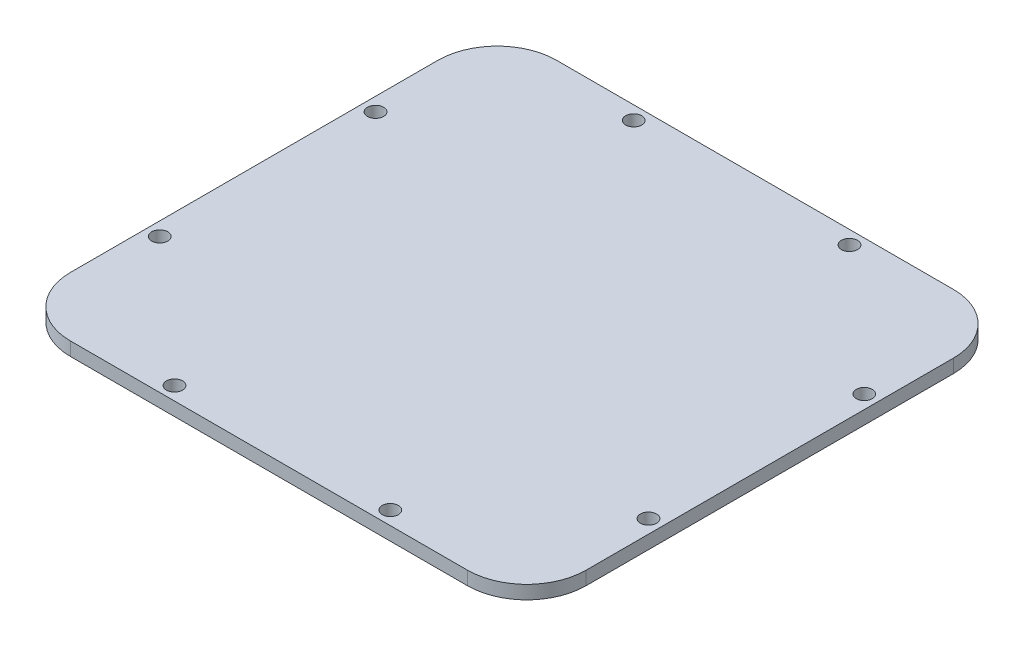
ISO-10303-21;
HEADER;
FILE_DESCRIPTION(('STEP AP214'),'2;1');
FILE_NAME('part.step','',(''),(''),'','','');
FILE_SCHEMA(('AUTOMOTIVE_DESIGN { 1 0 10303 214 1 1 1 1 }'));
ENDSEC;
DATA;
#1=APPLICATION_CONTEXT('core data for automotive mechanical design processes');
#2=APPLICATION_PROTOCOL_DEFINITION('international standard','automotive_design',2000,#1);
#3=PRODUCT_CONTEXT('',#1,'mechanical');
#4=PRODUCT('Part','Part','',(#3));
#5=PRODUCT_RELATED_PRODUCT_CATEGORY('part','',(#4));
#6=PRODUCT_DEFINITION_FORMATION('','',#4);
#7=PRODUCT_DEFINITION_CONTEXT('part definition',#1,'design');
#8=PRODUCT_DEFINITION('design','',#6,#7);
#9=PRODUCT_DEFINITION_SHAPE('','',#8);
#10=(LENGTH_UNIT() NAMED_UNIT(*) SI_UNIT(.MILLI.,.METRE.));
#11=(NAMED_UNIT(*) PLANE_ANGLE_UNIT() SI_UNIT($,.RADIAN.));
#12=(NAMED_UNIT(*) SI_UNIT($,.STERADIAN.) SOLID_ANGLE_UNIT());
#13=UNCERTAINTY_MEASURE_WITH_UNIT(LENGTH_MEASURE(1.E-05),#10,'distance_accuracy_value','');
#14=(GEOMETRIC_REPRESENTATION_CONTEXT(3) GLOBAL_UNCERTAINTY_ASSIGNED_CONTEXT((#13)) GLOBAL_UNIT_ASSIGNED_CONTEXT((#10,
#11,#12)) REPRESENTATION_CONTEXT('',''));
#15=CARTESIAN_POINT('',(0.,0.,0.));
#16=DIRECTION('',(0.,0.,1.));
#17=DIRECTION('',(1.,0.,0.));
#18=AXIS2_PLACEMENT_3D('',#15,#16,#17);
#19=CARTESIAN_POINT('',(0.,0.,0.));
#20=DIRECTION('',(0.,1.,0.));
#21=DIRECTION('',(0.,0.,1.));
#22=AXIS2_PLACEMENT_3D('',#19,#20,#21);
#23=PLANE('',#22);
#24=CARTESIAN_POINT('',(25.4,0.,-54.0512));
#25=DIRECTION('',(0.,-1.,0.));
#26=DIRECTION('',(0.,0.,-1.));
#27=AXIS2_PLACEMENT_3D('',#24,#25,#26);
#28=CIRCLE('',#27,1.89864999999999);
#29=CARTESIAN_POINT('',(25.4,0.,-55.94985));
#30=VERTEX_POINT('',#29);
#31=EDGE_CURVE('E224',#30,#30,#28,.T.);
#32=ORIENTED_EDGE('',*,*,#31,.F.);
#33=EDGE_LOOP('',(#32));
#34=FACE_BOUND('',#33,.T.);
#35=CARTESIAN_POINT('',(57.531,0.,-25.4));
#36=DIRECTION('',(0.,-1.,0.));
#37=DIRECTION('',(0.,0.,-1.));
#38=AXIS2_PLACEMENT_3D('',#35,#36,#37);
#39=CIRCLE('',#38,1.89864999999999);
#40=CARTESIAN_POINT('',(57.531,0.,-27.29865));
#41=VERTEX_POINT('',#40);
#42=EDGE_CURVE('E218',#41,#41,#39,.T.);
#43=ORIENTED_EDGE('',*,*,#42,.F.);
#44=EDGE_LOOP('',(#43));
#45=FACE_BOUND('',#44,.T.);
#46=CARTESIAN_POINT('',(57.531,0.,25.4));
#47=DIRECTION('',(0.,-1.,0.));
#48=DIRECTION('',(0.,0.,-1.));
#49=AXIS2_PLACEMENT_3D('',#46,#47,#48);
#50=CIRCLE('',#49,1.89864999999999);
#51=CARTESIAN_POINT('',(57.531,0.,23.50135));
#52=VERTEX_POINT('',#51);
#53=EDGE_CURVE('E212',#52,#52,#50,.T.);
#54=ORIENTED_EDGE('',*,*,#53,.F.);
#55=EDGE_LOOP('',(#54));
#56=FACE_BOUND('',#55,.T.);
#57=CARTESIAN_POINT('',(-25.4,0.,-54.0512));
#58=DIRECTION('',(0.,-1.,0.));
#59=DIRECTION('',(0.,0.,-1.));
#60=AXIS2_PLACEMENT_3D('',#57,#58,#59);
#61=CIRCLE('',#60,1.89864999999999);
#62=CARTESIAN_POINT('',(-25.4,0.,-55.94985));
#63=VERTEX_POINT('',#62);
#64=EDGE_CURVE('E200',#63,#63,#61,.T.);
#65=ORIENTED_EDGE('',*,*,#64,.F.);
#66=EDGE_LOOP('',(#65));
#67=FACE_BOUND('',#66,.T.);
#68=CARTESIAN_POINT('',(-57.531,0.,-25.4));
#69=DIRECTION('',(0.,-1.,0.));
#70=DIRECTION('',(0.,0.,-1.));
#71=AXIS2_PLACEMENT_3D('',#68,#69,#70);
#72=CIRCLE('',#71,1.89864999999999);
#73=CARTESIAN_POINT('',(-57.531,0.,-27.29865));
#74=VERTEX_POINT('',#73);
#75=EDGE_CURVE('E194',#74,#74,#72,.T.);
#76=ORIENTED_EDGE('',*,*,#75,.F.);
#77=EDGE_LOOP('',(#76));
#78=FACE_BOUND('',#77,.T.);
#79=CARTESIAN_POINT('',(-57.531,0.,25.4));
#80=DIRECTION('',(0.,-1.,0.));
#81=DIRECTION('',(0.,0.,-1.));
#82=AXIS2_PLACEMENT_3D('',#79,#80,#81);
#83=CIRCLE('',#82,1.89864999999999);
#84=CARTESIAN_POINT('',(-57.531,0.,23.50135));
#85=VERTEX_POINT('',#84);
#86=EDGE_CURVE('E188',#85,#85,#83,.T.);
#87=ORIENTED_EDGE('',*,*,#86,.F.);
#88=EDGE_LOOP('',(#87));
#89=FACE_BOUND('',#88,.T.);
#90=CARTESIAN_POINT('',(-25.4,0.,54.0512));
#91=DIRECTION('',(0.,-1.,0.));
#92=DIRECTION('',(0.,0.,-1.));
#93=AXIS2_PLACEMENT_3D('',#90,#91,#92);
#94=CIRCLE('',#93,1.89864999999999);
#95=CARTESIAN_POINT('',(-25.4,0.,52.15255));
#96=VERTEX_POINT('',#95);
#97=EDGE_CURVE('E133',#96,#96,#94,.T.);
#98=ORIENTED_EDGE('',*,*,#97,.F.);
#99=EDGE_LOOP('',(#98));
#100=FACE_BOUND('',#99,.T.);
#101=DIRECTION('',(0.,0.,1.));
#102=VECTOR('',#101,1.);
#103=CARTESIAN_POINT('',(-60.706,0.,57.2262));
#104=LINE('',#103,#102);
#105=CARTESIAN_POINT('',(-60.706,0.,-43.2562));
#106=VERTEX_POINT('',#105);
#107=CARTESIAN_POINT('',(-60.706,0.,43.2562));
#108=VERTEX_POINT('',#107);
#109=EDGE_CURVE('E116',#106,#108,#104,.T.);
#110=ORIENTED_EDGE('',*,*,#109,.F.);
#111=CARTESIAN_POINT('',(-46.736,0.,-43.2562));
#112=DIRECTION('',(0.,1.,0.));
#113=DIRECTION('',(0.,0.,1.));
#114=AXIS2_PLACEMENT_3D('',#111,#112,#113);
#115=CIRCLE('',#114,13.97);
#116=CARTESIAN_POINT('',(-46.736,0.,-57.2262));
#117=VERTEX_POINT('',#116);
#118=EDGE_CURVE('E99',#106,#117,#115,.F.);
#119=ORIENTED_EDGE('',*,*,#118,.T.);
#120=DIRECTION('',(-1.,0.,0.));
#121=VECTOR('',#120,1.);
#122=CARTESIAN_POINT('',(60.706,0.,-57.2262));
#123=LINE('',#122,#121);
#124=CARTESIAN_POINT('',(46.736,0.,-57.2262));
#125=VERTEX_POINT('',#124);
#126=EDGE_CURVE('E140',#125,#117,#123,.T.);
#127=ORIENTED_EDGE('',*,*,#126,.F.);
#128=CARTESIAN_POINT('',(46.736,0.,-43.2562));
#129=DIRECTION('',(0.,1.,0.));
#130=DIRECTION('',(0.,0.,1.));
#131=AXIS2_PLACEMENT_3D('',#128,#129,#130);
#132=CIRCLE('',#131,13.97);
#133=CARTESIAN_POINT('',(60.706,0.,-43.2562));
#134=VERTEX_POINT('',#133);
#135=EDGE_CURVE('E110',#125,#134,#132,.F.);
#136=ORIENTED_EDGE('',*,*,#135,.T.);
#137=DIRECTION('',(0.,0.,-1.));
#138=VECTOR('',#137,1.);
#139=CARTESIAN_POINT('',(60.706,0.,57.2262));
#140=LINE('',#139,#138);
#141=CARTESIAN_POINT('',(60.706,0.,43.2562));
#142=VERTEX_POINT('',#141);
#143=EDGE_CURVE('E130',#142,#134,#140,.T.);
#144=ORIENTED_EDGE('',*,*,#143,.F.);
#145=CARTESIAN_POINT('',(46.736,0.,43.2562));
#146=DIRECTION('',(0.,1.,0.));
#147=DIRECTION('',(0.,0.,1.));
#148=AXIS2_PLACEMENT_3D('',#145,#146,#147);
#149=CIRCLE('',#148,13.97);
#150=CARTESIAN_POINT('',(46.736,0.,57.2262));
#151=VERTEX_POINT('',#150);
#152=EDGE_CURVE('E120',#142,#151,#149,.F.);
#153=ORIENTED_EDGE('',*,*,#152,.T.);
#154=DIRECTION('',(1.,0.,0.));
#155=VECTOR('',#154,1.);
#156=CARTESIAN_POINT('',(60.706,0.,57.2262));
#157=LINE('',#156,#155);
#158=CARTESIAN_POINT('',(-46.736,0.,57.2262));
#159=VERTEX_POINT('',#158);
#160=EDGE_CURVE('E126',#159,#151,#157,.T.);
#161=ORIENTED_EDGE('',*,*,#160,.F.);
#162=CARTESIAN_POINT('',(-46.736,0.,43.2562));
#163=DIRECTION('',(0.,1.,0.));
#164=DIRECTION('',(0.,0.,1.));
#165=AXIS2_PLACEMENT_3D('',#162,#163,#164);
#166=CIRCLE('',#165,13.97);
#167=EDGE_CURVE('E125',#159,#108,#166,.F.);
#168=ORIENTED_EDGE('',*,*,#167,.T.);
#169=EDGE_LOOP('',(#110,#119,#127,#136,#144,#153,#161,#168));
#170=FACE_BOUND('',#169,.T.);
#171=CARTESIAN_POINT('',(25.4,0.,54.0512));
#172=DIRECTION('',(0.,-1.,0.));
#173=DIRECTION('',(0.,0.,-1.));
#174=AXIS2_PLACEMENT_3D('',#171,#172,#173);
#175=CIRCLE('',#174,1.89864999999999);
#176=CARTESIAN_POINT('',(25.4,0.,52.15255));
#177=VERTEX_POINT('',#176);
#178=EDGE_CURVE('E206',#177,#177,#175,.T.);
#179=ORIENTED_EDGE('',*,*,#178,.F.);
#180=EDGE_LOOP('',(#179));
#181=FACE_BOUND('',#180,.T.);
#182=ADVANCED_FACE('F32',(#34,#45,#56,#67,#78,#89,#100,#170,#181),#23,.F.);
#183=CARTESIAN_POINT('',(-60.706,3.175,57.2262));
#184=DIRECTION('',(1.,0.,0.));
#185=DIRECTION('',(0.,0.,-1.));
#186=AXIS2_PLACEMENT_3D('',#183,#184,#185);
#187=PLANE('',#186);
#188=DIRECTION('',(0.,0.,1.));
#189=VECTOR('',#188,1.);
#190=CARTESIAN_POINT('',(-60.706,3.175,57.2262));
#191=LINE('',#190,#189);
#192=CARTESIAN_POINT('',(-60.706,3.175,-43.2562));
#193=VERTEX_POINT('',#192);
#194=CARTESIAN_POINT('',(-60.706,3.175,43.2562));
#195=VERTEX_POINT('',#194);
#196=EDGE_CURVE('E119',#193,#195,#191,.T.);
#197=ORIENTED_EDGE('',*,*,#196,.F.);
#198=DIRECTION('',(0.,-1.,0.));
#199=VECTOR('',#198,1.);
#200=CARTESIAN_POINT('',(-60.706,3.175,-43.2562));
#201=LINE('',#200,#199);
#202=EDGE_CURVE('E103',#193,#106,#201,.T.);
#203=ORIENTED_EDGE('',*,*,#202,.T.);
#204=ORIENTED_EDGE('',*,*,#109,.T.);
#205=DIRECTION('',(0.,-1.,0.));
#206=VECTOR('',#205,1.);
#207=CARTESIAN_POINT('',(-60.706,3.175,43.2562));
#208=LINE('',#207,#206);
#209=EDGE_CURVE('E121',#108,#195,#208,.F.);
#210=ORIENTED_EDGE('',*,*,#209,.T.);
#211=EDGE_LOOP('',(#197,#203,#204,#210));
#212=FACE_BOUND('',#211,.T.);
#213=ADVANCED_FACE('F115',(#212),#187,.F.);
#214=CARTESIAN_POINT('',(60.706,3.175,57.2262));
#215=DIRECTION('',(0.,0.,-1.));
#216=DIRECTION('',(-1.,0.,0.));
#217=AXIS2_PLACEMENT_3D('',#214,#215,#216);
#218=PLANE('',#217);
#219=DIRECTION('',(1.,0.,0.));
#220=VECTOR('',#219,1.);
#221=CARTESIAN_POINT('',(60.706,3.175,57.2262));
#222=LINE('',#221,#220);
#223=CARTESIAN_POINT('',(-46.736,3.175,57.2262));
#224=VERTEX_POINT('',#223);
#225=CARTESIAN_POINT('',(46.736,3.175,57.2262));
#226=VERTEX_POINT('',#225);
#227=EDGE_CURVE('E163',#224,#226,#222,.T.);
#228=ORIENTED_EDGE('',*,*,#227,.F.);
#229=DIRECTION('',(0.,-1.,0.));
#230=VECTOR('',#229,1.);
#231=CARTESIAN_POINT('',(-46.736,3.175,57.2262));
#232=LINE('',#231,#230);
#233=EDGE_CURVE('E11',#224,#159,#232,.T.);
#234=ORIENTED_EDGE('',*,*,#233,.T.);
#235=ORIENTED_EDGE('',*,*,#160,.T.);
#236=DIRECTION('',(0.,-1.,0.));
#237=VECTOR('',#236,1.);
#238=CARTESIAN_POINT('',(46.736,3.175,57.2262));
#239=LINE('',#238,#237);
#240=EDGE_CURVE('E40',#151,#226,#239,.F.);
#241=ORIENTED_EDGE('',*,*,#240,.T.);
#242=EDGE_LOOP('',(#228,#234,#235,#241));
#243=FACE_BOUND('',#242,.T.);
#244=ADVANCED_FACE('F162',(#243),#218,.F.);
#245=CARTESIAN_POINT('',(60.706,3.175,57.2262));
#246=DIRECTION('',(-1.,0.,0.));
#247=DIRECTION('',(0.,0.,1.));
#248=AXIS2_PLACEMENT_3D('',#245,#246,#247);
#249=PLANE('',#248);
#250=ORIENTED_EDGE('',*,*,#143,.T.);
#251=DIRECTION('',(0.,-1.,0.));
#252=VECTOR('',#251,1.);
#253=CARTESIAN_POINT('',(60.706,3.175,-43.2562));
#254=LINE('',#253,#252);
#255=CARTESIAN_POINT('',(60.706,3.175,-43.2562));
#256=VERTEX_POINT('',#255);
#257=EDGE_CURVE('E47',#134,#256,#254,.F.);
#258=ORIENTED_EDGE('',*,*,#257,.T.);
#259=DIRECTION('',(0.,0.,-1.));
#260=VECTOR('',#259,1.);
#261=CARTESIAN_POINT('',(60.706,3.175,57.2262));
#262=LINE('',#261,#260);
#263=CARTESIAN_POINT('',(60.706,3.175,43.2562));
#264=VERTEX_POINT('',#263);
#265=EDGE_CURVE('E169',#264,#256,#262,.T.);
#266=ORIENTED_EDGE('',*,*,#265,.F.);
#267=DIRECTION('',(0.,-1.,0.));
#268=VECTOR('',#267,1.);
#269=CARTESIAN_POINT('',(60.706,3.175,43.2562));
#270=LINE('',#269,#268);
#271=EDGE_CURVE('E156',#264,#142,#270,.T.);
#272=ORIENTED_EDGE('',*,*,#271,.T.);
#273=EDGE_LOOP('',(#250,#258,#266,#272));
#274=FACE_BOUND('',#273,.T.);
#275=ADVANCED_FACE('F173',(#274),#249,.F.);
#276=CARTESIAN_POINT('',(60.706,3.175,-57.2262));
#277=DIRECTION('',(0.,0.,1.));
#278=DIRECTION('',(1.,0.,0.));
#279=AXIS2_PLACEMENT_3D('',#276,#277,#278);
#280=PLANE('',#279);
#281=ORIENTED_EDGE('',*,*,#126,.T.);
#282=DIRECTION('',(0.,-1.,0.));
#283=VECTOR('',#282,1.);
#284=CARTESIAN_POINT('',(-46.736,3.175,-57.2262));
#285=LINE('',#284,#283);
#286=CARTESIAN_POINT('',(-46.736,3.175,-57.2262));
#287=VERTEX_POINT('',#286);
#288=EDGE_CURVE('E104',#117,#287,#285,.F.);
#289=ORIENTED_EDGE('',*,*,#288,.T.);
#290=DIRECTION('',(-1.,0.,0.));
#291=VECTOR('',#290,1.);
#292=CARTESIAN_POINT('',(60.706,3.175,-57.2262));
#293=LINE('',#292,#291);
#294=CARTESIAN_POINT('',(46.736,3.175,-57.2262));
#295=VERTEX_POINT('',#294);
#296=EDGE_CURVE('E136',#295,#287,#293,.T.);
#297=ORIENTED_EDGE('',*,*,#296,.F.);
#298=DIRECTION('',(0.,-1.,0.));
#299=VECTOR('',#298,1.);
#300=CARTESIAN_POINT('',(46.736,3.175,-57.2262));
#301=LINE('',#300,#299);
#302=EDGE_CURVE('E109',#295,#125,#301,.T.);
#303=ORIENTED_EDGE('',*,*,#302,.T.);
#304=EDGE_LOOP('',(#281,#289,#297,#303));
#305=FACE_BOUND('',#304,.T.);
#306=ADVANCED_FACE('F180',(#305),#280,.F.);
#307=CARTESIAN_POINT('',(0.,3.175,0.));
#308=DIRECTION('',(0.,1.,0.));
#309=DIRECTION('',(0.,0.,1.));
#310=AXIS2_PLACEMENT_3D('',#307,#308,#309);
#311=PLANE('',#310);
#312=CARTESIAN_POINT('',(25.4,3.175,-54.0512));
#313=DIRECTION('',(0.,-1.,0.));
#314=DIRECTION('',(0.,0.,-1.));
#315=AXIS2_PLACEMENT_3D('',#312,#313,#314);
#316=CIRCLE('',#315,1.89865);
#317=CARTESIAN_POINT('',(25.4,3.175,-55.94985));
#318=VERTEX_POINT('',#317);
#319=EDGE_CURVE('E221',#318,#318,#316,.T.);
#320=ORIENTED_EDGE('',*,*,#319,.T.);
#321=EDGE_LOOP('',(#320));
#322=FACE_BOUND('',#321,.T.);
#323=CARTESIAN_POINT('',(57.531,3.175,-25.4));
#324=DIRECTION('',(0.,-1.,0.));
#325=DIRECTION('',(0.,0.,-1.));
#326=AXIS2_PLACEMENT_3D('',#323,#324,#325);
#327=CIRCLE('',#326,1.89865);
#328=CARTESIAN_POINT('',(57.531,3.175,-27.29865));
#329=VERTEX_POINT('',#328);
#330=EDGE_CURVE('E215',#329,#329,#327,.T.);
#331=ORIENTED_EDGE('',*,*,#330,.T.);
#332=EDGE_LOOP('',(#331));
#333=FACE_BOUND('',#332,.T.);
#334=CARTESIAN_POINT('',(57.531,3.175,25.4));
#335=DIRECTION('',(0.,-1.,0.));
#336=DIRECTION('',(0.,0.,-1.));
#337=AXIS2_PLACEMENT_3D('',#334,#335,#336);
#338=CIRCLE('',#337,1.89865);
#339=CARTESIAN_POINT('',(57.531,3.175,23.50135));
#340=VERTEX_POINT('',#339);
#341=EDGE_CURVE('E209',#340,#340,#338,.T.);
#342=ORIENTED_EDGE('',*,*,#341,.T.);
#343=EDGE_LOOP('',(#342));
#344=FACE_BOUND('',#343,.T.);
#345=CARTESIAN_POINT('',(25.4,3.175,54.0512));
#346=DIRECTION('',(0.,-1.,0.));
#347=DIRECTION('',(0.,0.,-1.));
#348=AXIS2_PLACEMENT_3D('',#345,#346,#347);
#349=CIRCLE('',#348,1.89865);
#350=CARTESIAN_POINT('',(25.4,3.175,52.15255));
#351=VERTEX_POINT('',#350);
#352=EDGE_CURVE('E203',#351,#351,#349,.T.);
#353=ORIENTED_EDGE('',*,*,#352,.T.);
#354=EDGE_LOOP('',(#353));
#355=FACE_BOUND('',#354,.T.);
#356=CARTESIAN_POINT('',(-25.4,3.175,-54.0512));
#357=DIRECTION('',(0.,-1.,0.));
#358=DIRECTION('',(0.,0.,-1.));
#359=AXIS2_PLACEMENT_3D('',#356,#357,#358);
#360=CIRCLE('',#359,1.89865);
#361=CARTESIAN_POINT('',(-25.4,3.175,-55.94985));
#362=VERTEX_POINT('',#361);
#363=EDGE_CURVE('E197',#362,#362,#360,.T.);
#364=ORIENTED_EDGE('',*,*,#363,.T.);
#365=EDGE_LOOP('',(#364));
#366=FACE_BOUND('',#365,.T.);
#367=CARTESIAN_POINT('',(-57.531,3.175,-25.4));
#368=DIRECTION('',(0.,-1.,0.));
#369=DIRECTION('',(0.,0.,-1.));
#370=AXIS2_PLACEMENT_3D('',#367,#368,#369);
#371=CIRCLE('',#370,1.89865);
#372=CARTESIAN_POINT('',(-57.531,3.175,-27.29865));
#373=VERTEX_POINT('',#372);
#374=EDGE_CURVE('E191',#373,#373,#371,.T.);
#375=ORIENTED_EDGE('',*,*,#374,.T.);
#376=EDGE_LOOP('',(#375));
#377=FACE_BOUND('',#376,.T.);
#378=CARTESIAN_POINT('',(-57.531,3.175,25.4));
#379=DIRECTION('',(0.,-1.,0.));
#380=DIRECTION('',(0.,0.,-1.));
#381=AXIS2_PLACEMENT_3D('',#378,#379,#380);
#382=CIRCLE('',#381,1.89865);
#383=CARTESIAN_POINT('',(-57.531,3.175,23.50135));
#384=VERTEX_POINT('',#383);
#385=EDGE_CURVE('E185',#384,#384,#382,.T.);
#386=ORIENTED_EDGE('',*,*,#385,.T.);
#387=EDGE_LOOP('',(#386));
#388=FACE_BOUND('',#387,.T.);
#389=CARTESIAN_POINT('',(-25.4,3.175,54.0512));
#390=DIRECTION('',(0.,-1.,0.));
#391=DIRECTION('',(0.,0.,-1.));
#392=AXIS2_PLACEMENT_3D('',#389,#390,#391);
#393=CIRCLE('',#392,1.89865);
#394=CARTESIAN_POINT('',(-25.4,3.175,52.15255));
#395=VERTEX_POINT('',#394);
#396=EDGE_CURVE('E127',#395,#395,#393,.T.);
#397=ORIENTED_EDGE('',*,*,#396,.T.);
#398=EDGE_LOOP('',(#397));
#399=FACE_BOUND('',#398,.T.);
#400=ORIENTED_EDGE('',*,*,#296,.T.);
#401=CARTESIAN_POINT('',(-46.736,3.175,-43.2562));
#402=DIRECTION('',(0.,1.,0.));
#403=DIRECTION('',(0.,0.,1.));
#404=AXIS2_PLACEMENT_3D('',#401,#402,#403);
#405=CIRCLE('',#404,13.97);
#406=EDGE_CURVE('E154',#287,#193,#405,.T.);
#407=ORIENTED_EDGE('',*,*,#406,.T.);
#408=ORIENTED_EDGE('',*,*,#196,.T.);
#409=CARTESIAN_POINT('',(-46.736,3.175,43.2562));
#410=DIRECTION('',(0.,1.,0.));
#411=DIRECTION('',(0.,0.,1.));
#412=AXIS2_PLACEMENT_3D('',#409,#410,#411);
#413=CIRCLE('',#412,13.97);
#414=EDGE_CURVE('E150',#195,#224,#413,.T.);
#415=ORIENTED_EDGE('',*,*,#414,.T.);
#416=ORIENTED_EDGE('',*,*,#227,.T.);
#417=CARTESIAN_POINT('',(46.736,3.175,43.2562));
#418=DIRECTION('',(0.,1.,0.));
#419=DIRECTION('',(0.,0.,1.));
#420=AXIS2_PLACEMENT_3D('',#417,#418,#419);
#421=CIRCLE('',#420,13.97);
#422=EDGE_CURVE('E54',#226,#264,#421,.T.);
#423=ORIENTED_EDGE('',*,*,#422,.T.);
#424=ORIENTED_EDGE('',*,*,#265,.T.);
#425=CARTESIAN_POINT('',(46.736,3.175,-43.2562));
#426=DIRECTION('',(0.,1.,0.));
#427=DIRECTION('',(0.,0.,1.));
#428=AXIS2_PLACEMENT_3D('',#425,#426,#427);
#429=CIRCLE('',#428,13.97);
#430=EDGE_CURVE('E152',#256,#295,#429,.T.);
#431=ORIENTED_EDGE('',*,*,#430,.T.);
#432=EDGE_LOOP('',(#400,#407,#408,#415,#416,#423,#424,#431));
#433=FACE_BOUND('',#432,.T.);
#434=ADVANCED_FACE('F167',(#322,#333,#344,#355,#366,#377,#388,#399,#433),#311,.T.);
#435=CARTESIAN_POINT('',(-46.736,3.175,-43.2562));
#436=DIRECTION('',(0.,-1.,0.));
#437=DIRECTION('',(0.,0.,-1.));
#438=AXIS2_PLACEMENT_3D('',#435,#436,#437);
#439=CYLINDRICAL_SURFACE('',#438,13.97);
#440=ORIENTED_EDGE('',*,*,#406,.F.);
#441=ORIENTED_EDGE('',*,*,#288,.F.);
#442=ORIENTED_EDGE('',*,*,#118,.F.);
#443=ORIENTED_EDGE('',*,*,#202,.F.);
#444=EDGE_LOOP('',(#440,#441,#442,#443));
#445=FACE_BOUND('',#444,.T.);
#446=ADVANCED_FACE('F102',(#445),#439,.T.);
#447=CARTESIAN_POINT('',(46.736,3.175,-43.2562));
#448=DIRECTION('',(0.,-1.,0.));
#449=DIRECTION('',(0.,0.,-1.));
#450=AXIS2_PLACEMENT_3D('',#447,#448,#449);
#451=CYLINDRICAL_SURFACE('',#450,13.97);
#452=ORIENTED_EDGE('',*,*,#430,.F.);
#453=ORIENTED_EDGE('',*,*,#257,.F.);
#454=ORIENTED_EDGE('',*,*,#135,.F.);
#455=ORIENTED_EDGE('',*,*,#302,.F.);
#456=EDGE_LOOP('',(#452,#453,#454,#455));
#457=FACE_BOUND('',#456,.T.);
#458=ADVANCED_FACE('F177',(#457),#451,.T.);
#459=CARTESIAN_POINT('',(-46.736,3.175,43.2562));
#460=DIRECTION('',(0.,-1.,0.));
#461=DIRECTION('',(0.,0.,-1.));
#462=AXIS2_PLACEMENT_3D('',#459,#460,#461);
#463=CYLINDRICAL_SURFACE('',#462,13.97);
#464=ORIENTED_EDGE('',*,*,#414,.F.);
#465=ORIENTED_EDGE('',*,*,#209,.F.);
#466=ORIENTED_EDGE('',*,*,#167,.F.);
#467=ORIENTED_EDGE('',*,*,#233,.F.);
#468=EDGE_LOOP('',(#464,#465,#466,#467));
#469=FACE_BOUND('',#468,.T.);
#470=ADVANCED_FACE('F257',(#469),#463,.T.);
#471=CARTESIAN_POINT('',(46.736,3.175,43.2562));
#472=DIRECTION('',(0.,-1.,0.));
#473=DIRECTION('',(0.,0.,-1.));
#474=AXIS2_PLACEMENT_3D('',#471,#472,#473);
#475=CYLINDRICAL_SURFACE('',#474,13.97);
#476=ORIENTED_EDGE('',*,*,#422,.F.);
#477=ORIENTED_EDGE('',*,*,#240,.F.);
#478=ORIENTED_EDGE('',*,*,#152,.F.);
#479=ORIENTED_EDGE('',*,*,#271,.F.);
#480=EDGE_LOOP('',(#476,#477,#478,#479));
#481=FACE_BOUND('',#480,.T.);
#482=ADVANCED_FACE('F34',(#481),#475,.T.);
#483=CARTESIAN_POINT('',(-25.4,0.,54.0512));
#484=DIRECTION('',(0.,-1.,0.));
#485=DIRECTION('',(0.,0.,-1.));
#486=AXIS2_PLACEMENT_3D('',#483,#484,#485);
#487=CYLINDRICAL_SURFACE('',#486,1.89865);
#488=ORIENTED_EDGE('',*,*,#396,.F.);
#489=EDGE_LOOP('',(#488));
#490=FACE_BOUND('',#489,.T.);
#491=ORIENTED_EDGE('',*,*,#97,.T.);
#492=EDGE_LOOP('',(#491));
#493=FACE_BOUND('',#492,.T.);
#494=ADVANCED_FACE('F245',(#490,#493),#487,.F.);
#495=CARTESIAN_POINT('',(-57.531,0.,25.4));
#496=DIRECTION('',(0.,-1.,0.));
#497=DIRECTION('',(0.,0.,-1.));
#498=AXIS2_PLACEMENT_3D('',#495,#496,#497);
#499=CYLINDRICAL_SURFACE('',#498,1.89865);
#500=ORIENTED_EDGE('',*,*,#385,.F.);
#501=EDGE_LOOP('',(#500));
#502=FACE_BOUND('',#501,.T.);
#503=ORIENTED_EDGE('',*,*,#86,.T.);
#504=EDGE_LOOP('',(#503));
#505=FACE_BOUND('',#504,.T.);
#506=ADVANCED_FACE('F247',(#502,#505),#499,.F.);
#507=CARTESIAN_POINT('',(-57.531,0.,-25.4));
#508=DIRECTION('',(0.,-1.,0.));
#509=DIRECTION('',(0.,0.,-1.));
#510=AXIS2_PLACEMENT_3D('',#507,#508,#509);
#511=CYLINDRICAL_SURFACE('',#510,1.89865);
#512=ORIENTED_EDGE('',*,*,#374,.F.);
#513=EDGE_LOOP('',(#512));
#514=FACE_BOUND('',#513,.T.);
#515=ORIENTED_EDGE('',*,*,#75,.T.);
#516=EDGE_LOOP('',(#515));
#517=FACE_BOUND('',#516,.T.);
#518=ADVANCED_FACE('F254',(#514,#517),#511,.F.);
#519=CARTESIAN_POINT('',(-25.4,0.,-54.0512));
#520=DIRECTION('',(0.,-1.,0.));
#521=DIRECTION('',(0.,0.,-1.));
#522=AXIS2_PLACEMENT_3D('',#519,#520,#521);
#523=CYLINDRICAL_SURFACE('',#522,1.89865);
#524=ORIENTED_EDGE('',*,*,#363,.F.);
#525=EDGE_LOOP('',(#524));
#526=FACE_BOUND('',#525,.T.);
#527=ORIENTED_EDGE('',*,*,#64,.T.);
#528=EDGE_LOOP('',(#527));
#529=FACE_BOUND('',#528,.T.);
#530=ADVANCED_FACE('F304',(#526,#529),#523,.F.);
#531=CARTESIAN_POINT('',(25.4,0.,54.0512));
#532=DIRECTION('',(0.,-1.,0.));
#533=DIRECTION('',(0.,0.,-1.));
#534=AXIS2_PLACEMENT_3D('',#531,#532,#533);
#535=CYLINDRICAL_SURFACE('',#534,1.89865);
#536=ORIENTED_EDGE('',*,*,#352,.F.);
#537=EDGE_LOOP('',(#536));
#538=FACE_BOUND('',#537,.T.);
#539=ORIENTED_EDGE('',*,*,#178,.T.);
#540=EDGE_LOOP('',(#539));
#541=FACE_BOUND('',#540,.T.);
#542=ADVANCED_FACE('F313',(#538,#541),#535,.F.);
#543=CARTESIAN_POINT('',(57.531,0.,25.4));
#544=DIRECTION('',(0.,-1.,0.));
#545=DIRECTION('',(0.,0.,-1.));
#546=AXIS2_PLACEMENT_3D('',#543,#544,#545);
#547=CYLINDRICAL_SURFACE('',#546,1.89865);
#548=ORIENTED_EDGE('',*,*,#341,.F.);
#549=EDGE_LOOP('',(#548));
#550=FACE_BOUND('',#549,.T.);
#551=ORIENTED_EDGE('',*,*,#53,.T.);
#552=EDGE_LOOP('',(#551));
#553=FACE_BOUND('',#552,.T.);
#554=ADVANCED_FACE('F337',(#550,#553),#547,.F.);
#555=CARTESIAN_POINT('',(57.531,0.,-25.4));
#556=DIRECTION('',(0.,-1.,0.));
#557=DIRECTION('',(0.,0.,-1.));
#558=AXIS2_PLACEMENT_3D('',#555,#556,#557);
#559=CYLINDRICAL_SURFACE('',#558,1.89865);
#560=ORIENTED_EDGE('',*,*,#330,.F.);
#561=EDGE_LOOP('',(#560));
#562=FACE_BOUND('',#561,.T.);
#563=ORIENTED_EDGE('',*,*,#42,.T.);
#564=EDGE_LOOP('',(#563));
#565=FACE_BOUND('',#564,.T.);
#566=ADVANCED_FACE('F347',(#562,#565),#559,.F.);
#567=CARTESIAN_POINT('',(25.4,0.,-54.0512));
#568=DIRECTION('',(0.,-1.,0.));
#569=DIRECTION('',(0.,0.,-1.));
#570=AXIS2_PLACEMENT_3D('',#567,#568,#569);
#571=CYLINDRICAL_SURFACE('',#570,1.89865);
#572=ORIENTED_EDGE('',*,*,#319,.F.);
#573=EDGE_LOOP('',(#572));
#574=FACE_BOUND('',#573,.T.);
#575=ORIENTED_EDGE('',*,*,#31,.T.);
#576=EDGE_LOOP('',(#575));
#577=FACE_BOUND('',#576,.T.);
#578=ADVANCED_FACE('F228',(#574,#577),#571,.F.);
#579=CLOSED_SHELL('',(#182,#213,#244,#275,#306,#434,#446,#458,#470,#482,#494,#506,#518,#530,
#542,#554,#566,#578));
#580=MANIFOLD_SOLID_BREP('B2',#579);
#581=ADVANCED_BREP_SHAPE_REPRESENTATION('',(#18,#580),#14);
#582=SHAPE_DEFINITION_REPRESENTATION(#9,#581);
ENDSEC;
END-ISO-10303-21;
